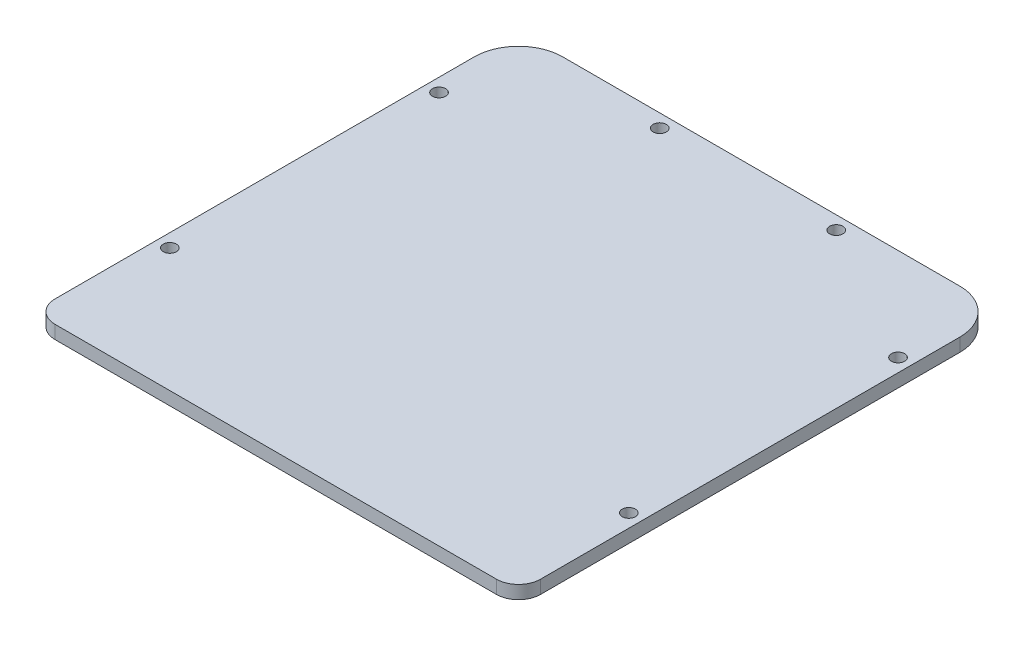
ISO-10303-21;
HEADER;
FILE_DESCRIPTION(('STEP AP214'),'2;1');
FILE_NAME('part.step','',(''),(''),'','','');
FILE_SCHEMA(('AUTOMOTIVE_DESIGN { 1 0 10303 214 1 1 1 1 }'));
ENDSEC;
DATA;
#1=APPLICATION_CONTEXT('core data for automotive mechanical design processes');
#2=APPLICATION_PROTOCOL_DEFINITION('international standard','automotive_design',2000,#1);
#3=PRODUCT_CONTEXT('',#1,'mechanical');
#4=PRODUCT('Part','Part','',(#3));
#5=PRODUCT_RELATED_PRODUCT_CATEGORY('part','',(#4));
#6=PRODUCT_DEFINITION_FORMATION('','',#4);
#7=PRODUCT_DEFINITION_CONTEXT('part definition',#1,'design');
#8=PRODUCT_DEFINITION('design','',#6,#7);
#9=PRODUCT_DEFINITION_SHAPE('','',#8);
#10=(LENGTH_UNIT() NAMED_UNIT(*) SI_UNIT(.MILLI.,.METRE.));
#11=(NAMED_UNIT(*) PLANE_ANGLE_UNIT() SI_UNIT($,.RADIAN.));
#12=(NAMED_UNIT(*) SI_UNIT($,.STERADIAN.) SOLID_ANGLE_UNIT());
#13=UNCERTAINTY_MEASURE_WITH_UNIT(LENGTH_MEASURE(1.E-05),#10,'distance_accuracy_value','');
#14=(GEOMETRIC_REPRESENTATION_CONTEXT(3) GLOBAL_UNCERTAINTY_ASSIGNED_CONTEXT((#13)) GLOBAL_UNIT_ASSIGNED_CONTEXT((#10,
#11,#12)) REPRESENTATION_CONTEXT('',''));
#15=CARTESIAN_POINT('',(0.,0.,0.));
#16=DIRECTION('',(0.,0.,1.));
#17=DIRECTION('',(1.,0.,0.));
#18=AXIS2_PLACEMENT_3D('',#15,#16,#17);
#19=CARTESIAN_POINT('',(45.3648924175193,-217.61956551421,-188.830274816639));
#20=DIRECTION('',(0.,-1.,0.));
#21=DIRECTION('',(0.,0.,-1.));
#22=AXIS2_PLACEMENT_3D('',#19,#20,#21);
#23=CYLINDRICAL_SURFACE('',#22,5.);
#24=CARTESIAN_POINT('',(45.3648924175193,-220.61956551421,-188.830274816639));
#25=DIRECTION('',(0.,1.,0.));
#26=DIRECTION('',(0.,0.,1.));
#27=AXIS2_PLACEMENT_3D('',#24,#25,#26);
#28=CIRCLE('',#27,5.);
#29=CARTESIAN_POINT('',(45.3648924175193,-220.61956551421,-183.830274816639));
#30=VERTEX_POINT('',#29);
#31=CARTESIAN_POINT('',(50.3648924175193,-220.61956551421,-188.830274816639));
#32=VERTEX_POINT('',#31);
#33=EDGE_CURVE('E132',#30,#32,#28,.T.);
#34=ORIENTED_EDGE('',*,*,#33,.T.);
#35=DIRECTION('',(0.,-1.,0.));
#36=VECTOR('',#35,1.);
#37=CARTESIAN_POINT('',(50.3648924175193,-217.61956551421,-188.830274816639));
#38=LINE('',#37,#36);
#39=CARTESIAN_POINT('',(50.3648924175193,-217.61956551421,-188.830274816639));
#40=VERTEX_POINT('',#39);
#41=EDGE_CURVE('E11',#40,#32,#38,.T.);
#42=ORIENTED_EDGE('',*,*,#41,.F.);
#43=CARTESIAN_POINT('',(45.3648924175193,-217.61956551421,-188.830274816639));
#44=DIRECTION('',(0.,1.,0.));
#45=DIRECTION('',(0.,0.,1.));
#46=AXIS2_PLACEMENT_3D('',#43,#44,#45);
#47=CIRCLE('',#46,5.);
#48=CARTESIAN_POINT('',(45.3648924175193,-217.61956551421,-183.830274816639));
#49=VERTEX_POINT('',#48);
#50=EDGE_CURVE('E147',#49,#40,#47,.T.);
#51=ORIENTED_EDGE('',*,*,#50,.F.);
#52=DIRECTION('',(0.,-1.,0.));
#53=VECTOR('',#52,1.);
#54=CARTESIAN_POINT('',(45.3648924175193,-217.61956551421,-183.830274816639));
#55=LINE('',#54,#53);
#56=EDGE_CURVE('E128',#49,#30,#55,.T.);
#57=ORIENTED_EDGE('',*,*,#56,.T.);
#58=EDGE_LOOP('',(#34,#42,#51,#57));
#59=FACE_BOUND('',#58,.T.);
#60=ADVANCED_FACE('F36',(#59),#23,.T.);
#61=CARTESIAN_POINT('',(50.3648924175193,-217.61956551421,-283.830274816639));
#62=DIRECTION('',(-1.,0.,0.));
#63=DIRECTION('',(0.,0.,1.));
#64=AXIS2_PLACEMENT_3D('',#61,#62,#63);
#65=PLANE('',#64);
#66=DIRECTION('',(0.,0.,-1.));
#67=VECTOR('',#66,1.);
#68=CARTESIAN_POINT('',(50.3648924175193,-220.61956551421,-283.830274816639));
#69=LINE('',#68,#67);
#70=CARTESIAN_POINT('',(50.3648924175193,-220.61956551421,-283.830274816639));
#71=VERTEX_POINT('',#70);
#72=EDGE_CURVE('E135',#32,#71,#69,.T.);
#73=ORIENTED_EDGE('',*,*,#72,.T.);
#74=DIRECTION('',(0.,-1.,0.));
#75=VECTOR('',#74,1.);
#76=CARTESIAN_POINT('',(50.3648924175193,-217.61956551421,-283.830274816639));
#77=LINE('',#76,#75);
#78=CARTESIAN_POINT('',(50.3648924175193,-217.61956551421,-283.830274816639));
#79=VERTEX_POINT('',#78);
#80=EDGE_CURVE('E44',#79,#71,#77,.T.);
#81=ORIENTED_EDGE('',*,*,#80,.F.);
#82=DIRECTION('',(0.,0.,-1.));
#83=VECTOR('',#82,1.);
#84=CARTESIAN_POINT('',(50.3648924175193,-217.61956551421,-283.830274816639));
#85=LINE('',#84,#83);
#86=EDGE_CURVE('E95',#40,#79,#85,.T.);
#87=ORIENTED_EDGE('',*,*,#86,.F.);
#88=ORIENTED_EDGE('',*,*,#41,.T.);
#89=EDGE_LOOP('',(#73,#81,#87,#88));
#90=FACE_BOUND('',#89,.T.);
#91=ADVANCED_FACE('F244',(#90),#65,.F.);
#92=CARTESIAN_POINT('',(40.3648924175193,-217.61956551421,-283.830274816639));
#93=DIRECTION('',(0.,-1.,0.));
#94=DIRECTION('',(0.,0.,-1.));
#95=AXIS2_PLACEMENT_3D('',#92,#93,#94);
#96=CYLINDRICAL_SURFACE('',#95,10.);
#97=CARTESIAN_POINT('',(40.3648924175193,-220.61956551421,-283.830274816639));
#98=DIRECTION('',(0.,1.,0.));
#99=DIRECTION('',(0.,0.,-1.));
#100=AXIS2_PLACEMENT_3D('',#97,#98,#99);
#101=CIRCLE('',#100,10.);
#102=CARTESIAN_POINT('',(40.3648924175193,-220.61956551421,-293.830274816639));
#103=VERTEX_POINT('',#102);
#104=EDGE_CURVE('E138',#71,#103,#101,.T.);
#105=ORIENTED_EDGE('',*,*,#104,.T.);
#106=DIRECTION('',(0.,-1.,0.));
#107=VECTOR('',#106,1.);
#108=CARTESIAN_POINT('',(40.3648924175193,-217.61956551421,-293.830274816639));
#109=LINE('',#108,#107);
#110=CARTESIAN_POINT('',(40.3648924175193,-217.61956551421,-293.830274816639));
#111=VERTEX_POINT('',#110);
#112=EDGE_CURVE('E154',#111,#103,#109,.T.);
#113=ORIENTED_EDGE('',*,*,#112,.F.);
#114=CARTESIAN_POINT('',(40.3648924175193,-217.61956551421,-283.830274816639));
#115=DIRECTION('',(0.,1.,0.));
#116=DIRECTION('',(0.,0.,-1.));
#117=AXIS2_PLACEMENT_3D('',#114,#115,#116);
#118=CIRCLE('',#117,10.);
#119=EDGE_CURVE('E162',#79,#111,#118,.T.);
#120=ORIENTED_EDGE('',*,*,#119,.F.);
#121=ORIENTED_EDGE('',*,*,#80,.T.);
#122=EDGE_LOOP('',(#105,#113,#120,#121));
#123=FACE_BOUND('',#122,.T.);
#124=ADVANCED_FACE('F160',(#123),#96,.T.);
#125=CARTESIAN_POINT('',(-49.6351075824806,-217.61956551421,-293.830274816639));
#126=DIRECTION('',(0.,0.,1.));
#127=DIRECTION('',(1.,0.,0.));
#128=AXIS2_PLACEMENT_3D('',#125,#126,#127);
#129=PLANE('',#128);
#130=DIRECTION('',(-1.,0.,0.));
#131=VECTOR('',#130,1.);
#132=CARTESIAN_POINT('',(-49.6351075824806,-220.61956551421,-293.830274816639));
#133=LINE('',#132,#131);
#134=CARTESIAN_POINT('',(-49.6351075824806,-220.61956551421,-293.830274816639));
#135=VERTEX_POINT('',#134);
#136=EDGE_CURVE('E140',#103,#135,#133,.T.);
#137=ORIENTED_EDGE('',*,*,#136,.T.);
#138=DIRECTION('',(0.,-1.,0.));
#139=VECTOR('',#138,1.);
#140=CARTESIAN_POINT('',(-49.6351075824806,-217.61956551421,-293.830274816639));
#141=LINE('',#140,#139);
#142=CARTESIAN_POINT('',(-49.6351075824806,-217.61956551421,-293.830274816639));
#143=VERTEX_POINT('',#142);
#144=EDGE_CURVE('E151',#143,#135,#141,.T.);
#145=ORIENTED_EDGE('',*,*,#144,.F.);
#146=DIRECTION('',(-1.,0.,0.));
#147=VECTOR('',#146,1.);
#148=CARTESIAN_POINT('',(-49.6351075824806,-217.61956551421,-293.830274816639));
#149=LINE('',#148,#147);
#150=EDGE_CURVE('E174',#111,#143,#149,.T.);
#151=ORIENTED_EDGE('',*,*,#150,.F.);
#152=ORIENTED_EDGE('',*,*,#112,.T.);
#153=EDGE_LOOP('',(#137,#145,#151,#152));
#154=FACE_BOUND('',#153,.T.);
#155=ADVANCED_FACE('F170',(#154),#129,.F.);
#156=CARTESIAN_POINT('',(-49.6351075824807,-217.61956551421,-283.830274816639));
#157=DIRECTION('',(0.,-1.,0.));
#158=DIRECTION('',(0.,0.,-1.));
#159=AXIS2_PLACEMENT_3D('',#156,#157,#158);
#160=CYLINDRICAL_SURFACE('',#159,10.);
#161=CARTESIAN_POINT('',(-49.6351075824807,-220.61956551421,-283.830274816639));
#162=DIRECTION('',(0.,1.,0.));
#163=DIRECTION('',(0.,0.,1.));
#164=AXIS2_PLACEMENT_3D('',#161,#162,#163);
#165=CIRCLE('',#164,10.);
#166=CARTESIAN_POINT('',(-59.6351075824807,-220.61956551421,-283.830274816639));
#167=VERTEX_POINT('',#166);
#168=EDGE_CURVE('E142',#135,#167,#165,.T.);
#169=ORIENTED_EDGE('',*,*,#168,.T.);
#170=DIRECTION('',(0.,-1.,0.));
#171=VECTOR('',#170,1.);
#172=CARTESIAN_POINT('',(-59.6351075824807,-217.61956551421,-283.830274816639));
#173=LINE('',#172,#171);
#174=CARTESIAN_POINT('',(-59.6351075824807,-217.61956551421,-283.830274816639));
#175=VERTEX_POINT('',#174);
#176=EDGE_CURVE('E123',#175,#167,#173,.T.);
#177=ORIENTED_EDGE('',*,*,#176,.F.);
#178=CARTESIAN_POINT('',(-49.6351075824807,-217.61956551421,-283.830274816639));
#179=DIRECTION('',(0.,1.,0.));
#180=DIRECTION('',(0.,0.,1.));
#181=AXIS2_PLACEMENT_3D('',#178,#179,#180);
#182=CIRCLE('',#181,10.);
#183=EDGE_CURVE('E114',#143,#175,#182,.T.);
#184=ORIENTED_EDGE('',*,*,#183,.F.);
#185=ORIENTED_EDGE('',*,*,#144,.T.);
#186=EDGE_LOOP('',(#169,#177,#184,#185));
#187=FACE_BOUND('',#186,.T.);
#188=ADVANCED_FACE('F173',(#187),#160,.T.);
#189=CARTESIAN_POINT('',(-59.6351075824807,-217.61956551421,-283.830274816639));
#190=DIRECTION('',(1.,0.,0.));
#191=DIRECTION('',(0.,0.,-1.));
#192=AXIS2_PLACEMENT_3D('',#189,#190,#191);
#193=PLANE('',#192);
#194=DIRECTION('',(0.,0.,1.));
#195=VECTOR('',#194,1.);
#196=CARTESIAN_POINT('',(-59.6351075824807,-220.61956551421,-283.830274816639));
#197=LINE('',#196,#195);
#198=CARTESIAN_POINT('',(-59.6351075824807,-220.61956551421,-188.830274816639));
#199=VERTEX_POINT('',#198);
#200=EDGE_CURVE('E122',#167,#199,#197,.T.);
#201=ORIENTED_EDGE('',*,*,#200,.T.);
#202=DIRECTION('',(0.,-1.,0.));
#203=VECTOR('',#202,1.);
#204=CARTESIAN_POINT('',(-59.6351075824807,-217.61956551421,-188.830274816639));
#205=LINE('',#204,#203);
#206=CARTESIAN_POINT('',(-59.6351075824807,-217.61956551421,-188.830274816639));
#207=VERTEX_POINT('',#206);
#208=EDGE_CURVE('E119',#207,#199,#205,.T.);
#209=ORIENTED_EDGE('',*,*,#208,.F.);
#210=DIRECTION('',(0.,0.,1.));
#211=VECTOR('',#210,1.);
#212=CARTESIAN_POINT('',(-59.6351075824807,-217.61956551421,-283.830274816639));
#213=LINE('',#212,#211);
#214=EDGE_CURVE('E108',#175,#207,#213,.T.);
#215=ORIENTED_EDGE('',*,*,#214,.F.);
#216=ORIENTED_EDGE('',*,*,#176,.T.);
#217=EDGE_LOOP('',(#201,#209,#215,#216));
#218=FACE_BOUND('',#217,.T.);
#219=ADVANCED_FACE('F120',(#218),#193,.F.);
#220=CARTESIAN_POINT('',(-54.6351075824807,-217.61956551421,-188.830274816639));
#221=DIRECTION('',(0.,-1.,0.));
#222=DIRECTION('',(0.,0.,-1.));
#223=AXIS2_PLACEMENT_3D('',#220,#221,#222);
#224=CYLINDRICAL_SURFACE('',#223,5.);
#225=CARTESIAN_POINT('',(-54.6351075824807,-220.61956551421,-188.830274816639));
#226=DIRECTION('',(0.,1.,0.));
#227=DIRECTION('',(0.,0.,1.));
#228=AXIS2_PLACEMENT_3D('',#225,#226,#227);
#229=CIRCLE('',#228,5.);
#230=CARTESIAN_POINT('',(-54.6351075824806,-220.61956551421,-183.830274816639));
#231=VERTEX_POINT('',#230);
#232=EDGE_CURVE('E81',#199,#231,#229,.T.);
#233=ORIENTED_EDGE('',*,*,#232,.T.);
#234=DIRECTION('',(0.,-1.,0.));
#235=VECTOR('',#234,1.);
#236=CARTESIAN_POINT('',(-54.6351075824806,-217.61956551421,-183.830274816639));
#237=LINE('',#236,#235);
#238=CARTESIAN_POINT('',(-54.6351075824806,-217.61956551421,-183.830274816639));
#239=VERTEX_POINT('',#238);
#240=EDGE_CURVE('E124',#239,#231,#237,.T.);
#241=ORIENTED_EDGE('',*,*,#240,.F.);
#242=CARTESIAN_POINT('',(-54.6351075824807,-217.61956551421,-188.830274816639));
#243=DIRECTION('',(0.,1.,0.));
#244=DIRECTION('',(0.,0.,1.));
#245=AXIS2_PLACEMENT_3D('',#242,#243,#244);
#246=CIRCLE('',#245,5.);
#247=EDGE_CURVE('E112',#207,#239,#246,.T.);
#248=ORIENTED_EDGE('',*,*,#247,.F.);
#249=ORIENTED_EDGE('',*,*,#208,.T.);
#250=EDGE_LOOP('',(#233,#241,#248,#249));
#251=FACE_BOUND('',#250,.T.);
#252=ADVANCED_FACE('F126',(#251),#224,.T.);
#253=CARTESIAN_POINT('',(-54.6351075824806,-217.61956551421,-183.830274816639));
#254=DIRECTION('',(0.,0.,-1.));
#255=DIRECTION('',(-1.,0.,0.));
#256=AXIS2_PLACEMENT_3D('',#253,#254,#255);
#257=PLANE('',#256);
#258=DIRECTION('',(1.,0.,0.));
#259=VECTOR('',#258,1.);
#260=CARTESIAN_POINT('',(-54.6351075824806,-220.61956551421,-183.830274816639));
#261=LINE('',#260,#259);
#262=EDGE_CURVE('E87',#231,#30,#261,.T.);
#263=ORIENTED_EDGE('',*,*,#262,.T.);
#264=ORIENTED_EDGE('',*,*,#56,.F.);
#265=DIRECTION('',(1.,0.,0.));
#266=VECTOR('',#265,1.);
#267=CARTESIAN_POINT('',(-54.6351075824806,-217.61956551421,-183.830274816639));
#268=LINE('',#267,#266);
#269=EDGE_CURVE('E52',#239,#49,#268,.T.);
#270=ORIENTED_EDGE('',*,*,#269,.F.);
#271=ORIENTED_EDGE('',*,*,#240,.T.);
#272=EDGE_LOOP('',(#263,#264,#270,#271));
#273=FACE_BOUND('',#272,.T.);
#274=ADVANCED_FACE('F228',(#273),#257,.F.);
#275=CARTESIAN_POINT('',(45.3648924175193,-217.61956551421,-188.830274816639));
#276=DIRECTION('',(0.,1.,0.));
#277=DIRECTION('',(0.,0.,1.));
#278=AXIS2_PLACEMENT_3D('',#275,#276,#277);
#279=PLANE('',#278);
#280=CARTESIAN_POINT('',(15.3648924175192,-217.61956551421,-290.833255232378));
#281=DIRECTION('',(0.,1.,0.));
#282=DIRECTION('',(0.,0.,1.));
#283=AXIS2_PLACEMENT_3D('',#280,#281,#282);
#284=CIRCLE('',#283,1.5);
#285=CARTESIAN_POINT('',(15.3648924175192,-217.61956551421,-289.333255232378));
#286=VERTEX_POINT('',#285);
#287=EDGE_CURVE('E205',#286,#286,#284,.T.);
#288=ORIENTED_EDGE('',*,*,#287,.F.);
#289=EDGE_LOOP('',(#288));
#290=FACE_BOUND('',#289,.T.);
#291=CARTESIAN_POINT('',(47.3648924175181,-217.61956551421,-272.830274816639));
#292=DIRECTION('',(0.,1.,0.));
#293=DIRECTION('',(0.,0.,1.));
#294=AXIS2_PLACEMENT_3D('',#291,#292,#293);
#295=CIRCLE('',#294,1.49999999999998);
#296=CARTESIAN_POINT('',(47.3648924175181,-217.61956551421,-271.330274816639));
#297=VERTEX_POINT('',#296);
#298=EDGE_CURVE('E199',#297,#297,#295,.T.);
#299=ORIENTED_EDGE('',*,*,#298,.F.);
#300=EDGE_LOOP('',(#299));
#301=FACE_BOUND('',#300,.T.);
#302=CARTESIAN_POINT('',(47.3648924175193,-217.61956551421,-211.830274816639));
#303=DIRECTION('',(0.,1.,0.));
#304=DIRECTION('',(0.,0.,1.));
#305=AXIS2_PLACEMENT_3D('',#302,#303,#304);
#306=CIRCLE('',#305,1.5);
#307=CARTESIAN_POINT('',(47.3648924175193,-217.61956551421,-210.330274816639));
#308=VERTEX_POINT('',#307);
#309=EDGE_CURVE('E193',#308,#308,#306,.T.);
#310=ORIENTED_EDGE('',*,*,#309,.F.);
#311=EDGE_LOOP('',(#310));
#312=FACE_BOUND('',#311,.T.);
#313=CARTESIAN_POINT('',(-56.6351075824807,-217.61956551421,-211.830274816639));
#314=DIRECTION('',(0.,1.,0.));
#315=DIRECTION('',(0.,0.,1.));
#316=AXIS2_PLACEMENT_3D('',#313,#314,#315);
#317=CIRCLE('',#316,1.5);
#318=CARTESIAN_POINT('',(-56.6351075824807,-217.61956551421,-210.330274816639));
#319=VERTEX_POINT('',#318);
#320=EDGE_CURVE('E186',#319,#319,#317,.T.);
#321=ORIENTED_EDGE('',*,*,#320,.F.);
#322=EDGE_LOOP('',(#321));
#323=FACE_BOUND('',#322,.T.);
#324=CARTESIAN_POINT('',(-56.6351075824807,-217.61956551421,-272.830274816639));
#325=DIRECTION('',(0.,1.,0.));
#326=DIRECTION('',(0.,0.,1.));
#327=AXIS2_PLACEMENT_3D('',#324,#325,#326);
#328=CIRCLE('',#327,1.50000000000001);
#329=CARTESIAN_POINT('',(-56.6351075824807,-217.61956551421,-271.330274816639));
#330=VERTEX_POINT('',#329);
#331=EDGE_CURVE('E210',#330,#330,#328,.T.);
#332=ORIENTED_EDGE('',*,*,#331,.F.);
#333=EDGE_LOOP('',(#332));
#334=FACE_BOUND('',#333,.T.);
#335=CARTESIAN_POINT('',(-24.6351075824807,-217.61956551421,-290.833255232378));
#336=DIRECTION('',(0.,1.,0.));
#337=DIRECTION('',(0.,0.,1.));
#338=AXIS2_PLACEMENT_3D('',#335,#336,#337);
#339=CIRCLE('',#338,1.49999999999997);
#340=CARTESIAN_POINT('',(-24.6351075824807,-217.61956551421,-289.333255232378));
#341=VERTEX_POINT('',#340);
#342=EDGE_CURVE('E180',#341,#341,#339,.T.);
#343=ORIENTED_EDGE('',*,*,#342,.F.);
#344=EDGE_LOOP('',(#343));
#345=FACE_BOUND('',#344,.T.);
#346=ORIENTED_EDGE('',*,*,#50,.T.);
#347=ORIENTED_EDGE('',*,*,#86,.T.);
#348=ORIENTED_EDGE('',*,*,#119,.T.);
#349=ORIENTED_EDGE('',*,*,#150,.T.);
#350=ORIENTED_EDGE('',*,*,#183,.T.);
#351=ORIENTED_EDGE('',*,*,#214,.T.);
#352=ORIENTED_EDGE('',*,*,#247,.T.);
#353=ORIENTED_EDGE('',*,*,#269,.T.);
#354=EDGE_LOOP('',(#346,#347,#348,#349,#350,#351,#352,#353));
#355=FACE_BOUND('',#354,.T.);
#356=ADVANCED_FACE('F110',(#290,#301,#312,#323,#334,#345,#355),#279,.T.);
#357=CARTESIAN_POINT('',(45.3648924175193,-220.61956551421,-188.830274816639));
#358=DIRECTION('',(0.,1.,0.));
#359=DIRECTION('',(0.,0.,1.));
#360=AXIS2_PLACEMENT_3D('',#357,#358,#359);
#361=PLANE('',#360);
#362=CARTESIAN_POINT('',(15.3648924175192,-220.61956551421,-290.833255232378));
#363=DIRECTION('',(0.,1.,0.));
#364=DIRECTION('',(0.,0.,1.));
#365=AXIS2_PLACEMENT_3D('',#362,#363,#364);
#366=CIRCLE('',#365,1.5);
#367=CARTESIAN_POINT('',(15.3648924175192,-220.61956551421,-289.333255232378));
#368=VERTEX_POINT('',#367);
#369=EDGE_CURVE('E183',#368,#368,#366,.T.);
#370=ORIENTED_EDGE('',*,*,#369,.T.);
#371=EDGE_LOOP('',(#370));
#372=FACE_BOUND('',#371,.T.);
#373=CARTESIAN_POINT('',(47.3648924175181,-220.61956551421,-272.830274816639));
#374=DIRECTION('',(0.,1.,0.));
#375=DIRECTION('',(0.,0.,1.));
#376=AXIS2_PLACEMENT_3D('',#373,#374,#375);
#377=CIRCLE('',#376,1.49999999999998);
#378=CARTESIAN_POINT('',(47.3648924175181,-220.61956551421,-271.330274816639));
#379=VERTEX_POINT('',#378);
#380=EDGE_CURVE('E202',#379,#379,#377,.T.);
#381=ORIENTED_EDGE('',*,*,#380,.T.);
#382=EDGE_LOOP('',(#381));
#383=FACE_BOUND('',#382,.T.);
#384=CARTESIAN_POINT('',(47.3648924175193,-220.61956551421,-211.830274816639));
#385=DIRECTION('',(0.,1.,0.));
#386=DIRECTION('',(0.,0.,1.));
#387=AXIS2_PLACEMENT_3D('',#384,#385,#386);
#388=CIRCLE('',#387,1.5);
#389=CARTESIAN_POINT('',(47.3648924175193,-220.61956551421,-210.330274816639));
#390=VERTEX_POINT('',#389);
#391=EDGE_CURVE('E196',#390,#390,#388,.T.);
#392=ORIENTED_EDGE('',*,*,#391,.T.);
#393=EDGE_LOOP('',(#392));
#394=FACE_BOUND('',#393,.T.);
#395=CARTESIAN_POINT('',(-56.6351075824807,-220.61956551421,-211.830274816639));
#396=DIRECTION('',(0.,1.,0.));
#397=DIRECTION('',(0.,0.,1.));
#398=AXIS2_PLACEMENT_3D('',#395,#396,#397);
#399=CIRCLE('',#398,1.5);
#400=CARTESIAN_POINT('',(-56.6351075824807,-220.61956551421,-210.330274816639));
#401=VERTEX_POINT('',#400);
#402=EDGE_CURVE('E189',#401,#401,#399,.T.);
#403=ORIENTED_EDGE('',*,*,#402,.T.);
#404=EDGE_LOOP('',(#403));
#405=FACE_BOUND('',#404,.T.);
#406=CARTESIAN_POINT('',(-56.6351075824807,-220.61956551421,-272.830274816639));
#407=DIRECTION('',(0.,1.,0.));
#408=DIRECTION('',(0.,0.,1.));
#409=AXIS2_PLACEMENT_3D('',#406,#407,#408);
#410=CIRCLE('',#409,1.50000000000001);
#411=CARTESIAN_POINT('',(-56.6351075824807,-220.61956551421,-271.330274816639));
#412=VERTEX_POINT('',#411);
#413=EDGE_CURVE('E190',#412,#412,#410,.T.);
#414=ORIENTED_EDGE('',*,*,#413,.T.);
#415=EDGE_LOOP('',(#414));
#416=FACE_BOUND('',#415,.T.);
#417=CARTESIAN_POINT('',(-24.6351075824807,-220.61956551421,-290.833255232378));
#418=DIRECTION('',(0.,1.,0.));
#419=DIRECTION('',(0.,0.,1.));
#420=AXIS2_PLACEMENT_3D('',#417,#418,#419);
#421=CIRCLE('',#420,1.49999999999997);
#422=CARTESIAN_POINT('',(-24.6351075824807,-220.61956551421,-289.333255232378));
#423=VERTEX_POINT('',#422);
#424=EDGE_CURVE('E136',#423,#423,#421,.T.);
#425=ORIENTED_EDGE('',*,*,#424,.T.);
#426=EDGE_LOOP('',(#425));
#427=FACE_BOUND('',#426,.T.);
#428=ORIENTED_EDGE('',*,*,#33,.F.);
#429=ORIENTED_EDGE('',*,*,#262,.F.);
#430=ORIENTED_EDGE('',*,*,#232,.F.);
#431=ORIENTED_EDGE('',*,*,#200,.F.);
#432=ORIENTED_EDGE('',*,*,#168,.F.);
#433=ORIENTED_EDGE('',*,*,#136,.F.);
#434=ORIENTED_EDGE('',*,*,#104,.F.);
#435=ORIENTED_EDGE('',*,*,#72,.F.);
#436=EDGE_LOOP('',(#428,#429,#430,#431,#432,#433,#434,#435));
#437=FACE_BOUND('',#436,.T.);
#438=ADVANCED_FACE('F166',(#372,#383,#394,#405,#416,#427,#437),#361,.F.);
#439=CARTESIAN_POINT('',(-24.6351075824807,-220.61956551421,-290.833255232378));
#440=DIRECTION('',(0.,1.,0.));
#441=DIRECTION('',(0.,0.,1.));
#442=AXIS2_PLACEMENT_3D('',#439,#440,#441);
#443=CYLINDRICAL_SURFACE('',#442,1.49999999999997);
#444=ORIENTED_EDGE('',*,*,#424,.F.);
#445=EDGE_LOOP('',(#444));
#446=FACE_BOUND('',#445,.T.);
#447=ORIENTED_EDGE('',*,*,#342,.T.);
#448=EDGE_LOOP('',(#447));
#449=FACE_BOUND('',#448,.T.);
#450=ADVANCED_FACE('F222',(#446,#449),#443,.F.);
#451=CARTESIAN_POINT('',(-56.6351075824807,-220.61956551421,-272.830274816639));
#452=DIRECTION('',(0.,1.,0.));
#453=DIRECTION('',(0.,0.,1.));
#454=AXIS2_PLACEMENT_3D('',#451,#452,#453);
#455=CYLINDRICAL_SURFACE('',#454,1.50000000000001);
#456=ORIENTED_EDGE('',*,*,#413,.F.);
#457=EDGE_LOOP('',(#456));
#458=FACE_BOUND('',#457,.T.);
#459=ORIENTED_EDGE('',*,*,#331,.T.);
#460=EDGE_LOOP('',(#459));
#461=FACE_BOUND('',#460,.T.);
#462=ADVANCED_FACE('F218',(#458,#461),#455,.F.);
#463=CARTESIAN_POINT('',(-56.6351075824807,-220.61956551421,-211.830274816639));
#464=DIRECTION('',(0.,1.,0.));
#465=DIRECTION('',(0.,0.,1.));
#466=AXIS2_PLACEMENT_3D('',#463,#464,#465);
#467=CYLINDRICAL_SURFACE('',#466,1.5);
#468=ORIENTED_EDGE('',*,*,#402,.F.);
#469=EDGE_LOOP('',(#468));
#470=FACE_BOUND('',#469,.T.);
#471=ORIENTED_EDGE('',*,*,#320,.T.);
#472=EDGE_LOOP('',(#471));
#473=FACE_BOUND('',#472,.T.);
#474=ADVANCED_FACE('F221',(#470,#473),#467,.F.);
#475=CARTESIAN_POINT('',(47.3648924175193,-220.61956551421,-211.830274816639));
#476=DIRECTION('',(0.,1.,0.));
#477=DIRECTION('',(0.,0.,1.));
#478=AXIS2_PLACEMENT_3D('',#475,#476,#477);
#479=CYLINDRICAL_SURFACE('',#478,1.5);
#480=ORIENTED_EDGE('',*,*,#391,.F.);
#481=EDGE_LOOP('',(#480));
#482=FACE_BOUND('',#481,.T.);
#483=ORIENTED_EDGE('',*,*,#309,.T.);
#484=EDGE_LOOP('',(#483));
#485=FACE_BOUND('',#484,.T.);
#486=ADVANCED_FACE('F320',(#482,#485),#479,.F.);
#487=CARTESIAN_POINT('',(47.3648924175181,-220.61956551421,-272.830274816639));
#488=DIRECTION('',(0.,1.,0.));
#489=DIRECTION('',(0.,0.,1.));
#490=AXIS2_PLACEMENT_3D('',#487,#488,#489);
#491=CYLINDRICAL_SURFACE('',#490,1.49999999999998);
#492=ORIENTED_EDGE('',*,*,#380,.F.);
#493=EDGE_LOOP('',(#492));
#494=FACE_BOUND('',#493,.T.);
#495=ORIENTED_EDGE('',*,*,#298,.T.);
#496=EDGE_LOOP('',(#495));
#497=FACE_BOUND('',#496,.T.);
#498=ADVANCED_FACE('F329',(#494,#497),#491,.F.);
#499=CARTESIAN_POINT('',(15.3648924175192,-220.61956551421,-290.833255232378));
#500=DIRECTION('',(0.,1.,0.));
#501=DIRECTION('',(0.,0.,1.));
#502=AXIS2_PLACEMENT_3D('',#499,#500,#501);
#503=CYLINDRICAL_SURFACE('',#502,1.5);
#504=ORIENTED_EDGE('',*,*,#369,.F.);
#505=EDGE_LOOP('',(#504));
#506=FACE_BOUND('',#505,.T.);
#507=ORIENTED_EDGE('',*,*,#287,.T.);
#508=EDGE_LOOP('',(#507));
#509=FACE_BOUND('',#508,.T.);
#510=ADVANCED_FACE('F339',(#506,#509),#503,.F.);
#511=CLOSED_SHELL('',(#60,#91,#124,#155,#188,#219,#252,#274,#356,#438,#450,#462,#474,#486,#498,#510));
#512=MANIFOLD_SOLID_BREP('B2',#511);
#513=ADVANCED_BREP_SHAPE_REPRESENTATION('',(#18,#512),#14);
#514=SHAPE_DEFINITION_REPRESENTATION(#9,#513);
ENDSEC;
END-ISO-10303-21;
